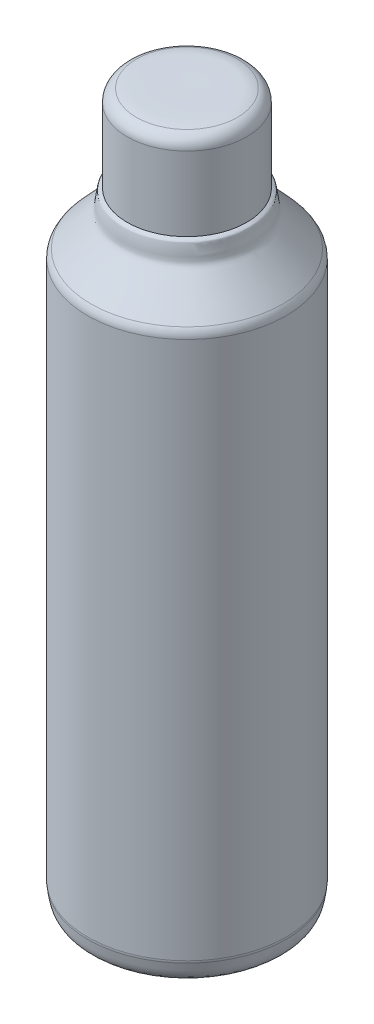
ISO-10303-21;
HEADER;
FILE_DESCRIPTION(('STEP AP214'),'2;1');
FILE_NAME('part.step','',(''),(''),'','','');
FILE_SCHEMA(('AUTOMOTIVE_DESIGN { 1 0 10303 214 1 1 1 1 }'));
ENDSEC;
DATA;
#1=APPLICATION_CONTEXT('core data for automotive mechanical design processes');
#2=APPLICATION_PROTOCOL_DEFINITION('international standard','automotive_design',2000,#1);
#3=PRODUCT_CONTEXT('',#1,'mechanical');
#4=PRODUCT('Part','Part','',(#3));
#5=PRODUCT_RELATED_PRODUCT_CATEGORY('part','',(#4));
#6=PRODUCT_DEFINITION_FORMATION('','',#4);
#7=PRODUCT_DEFINITION_CONTEXT('part definition',#1,'design');
#8=PRODUCT_DEFINITION('design','',#6,#7);
#9=PRODUCT_DEFINITION_SHAPE('','',#8);
#10=(LENGTH_UNIT() NAMED_UNIT(*) SI_UNIT(.MILLI.,.METRE.));
#11=(NAMED_UNIT(*) PLANE_ANGLE_UNIT() SI_UNIT($,.RADIAN.));
#12=(NAMED_UNIT(*) SI_UNIT($,.STERADIAN.) SOLID_ANGLE_UNIT());
#13=UNCERTAINTY_MEASURE_WITH_UNIT(LENGTH_MEASURE(1.E-05),#10,'distance_accuracy_value','');
#14=(GEOMETRIC_REPRESENTATION_CONTEXT(3) GLOBAL_UNCERTAINTY_ASSIGNED_CONTEXT((#13)) GLOBAL_UNIT_ASSIGNED_CONTEXT((#10,
#11,#12)) REPRESENTATION_CONTEXT('',''));
#15=CARTESIAN_POINT('',(0.,0.,0.));
#16=DIRECTION('',(0.,0.,1.));
#17=DIRECTION('',(1.,0.,0.));
#18=AXIS2_PLACEMENT_3D('',#15,#16,#17);
#19=CARTESIAN_POINT('',(253.,513.,0.));
#20=CARTESIAN_POINT('',(248.636070131771,510.818035065885,0.));
#21=CARTESIAN_POINT('',(250.831851320473,512.548639495541,0.));
#22=CARTESIAN_POINT('',(249.,504.,0.));
#23=CARTESIAN_POINT('',(248.575161436687,502.017420037871,0.));
#24=CARTESIAN_POINT('',(248.753027096743,499.882567741857,0.));
#25=CARTESIAN_POINT('',(248.,498.,0.));
#26=CARTESIAN_POINT('',(247.38101553941,496.452538848524,0.));
#27=CARTESIAN_POINT('',(246.097507679781,495.254294491178,0.));
#28=CARTESIAN_POINT('',(245.,494.,0.));
#29=CARTESIAN_POINT('',(238.404943019685,486.462792022498,0.));
#30=CARTESIAN_POINT('',(231.364357937615,479.199956821867,0.));
#31=CARTESIAN_POINT('',(224.604387653401,471.772395410952,0.));
#32=B_SPLINE_CURVE_WITH_KNOTS('',3,(#19,#20,#21,#22,#23,#24,#25,#26,#27,#28,#29,#30,#31),
.UNSPECIFIED.,.F.,.F.,(4,3,3,3,4),(1.0735522867203,2.0735522867203,3.0735522867203,
4.0735522867203,5.),.UNSPECIFIED.);
#33=CARTESIAN_POINT('',(299.869822457415,19.9699814524605,0.));
#34=DIRECTION('',(0.,-1.,0.));
#35=AXIS1_PLACEMENT('',#33,#34);
#36=SURFACE_OF_REVOLUTION('',#32,#35);
#37=CARTESIAN_POINT('',(299.869822457415,471.772395410952,0.));
#38=DIRECTION('',(0.,-1.,0.));
#39=DIRECTION('',(1.,0.,0.));
#40=AXIS2_PLACEMENT_3D('',#37,#38,#39);
#41=CIRCLE('',#40,75.2654348040142);
#42=CARTESIAN_POINT('',(375.13525726143,471.772395410952,0.));
#43=VERTEX_POINT('',#42);
#44=EDGE_CURVE('E11',#43,#43,#41,.T.);
#45=ORIENTED_EDGE('',*,*,#44,.F.);
#46=EDGE_LOOP('',(#45));
#47=FACE_BOUND('',#46,.T.);
#48=CARTESIAN_POINT('',(299.869822457415,513.,0.));
#49=DIRECTION('',(0.,-1.,0.));
#50=DIRECTION('',(1.,0.,0.));
#51=AXIS2_PLACEMENT_3D('',#48,#49,#50);
#52=CIRCLE('',#51,46.8698224574154);
#53=CARTESIAN_POINT('',(346.739644914831,513.,0.));
#54=VERTEX_POINT('',#53);
#55=EDGE_CURVE('E95',#54,#54,#52,.T.);
#56=ORIENTED_EDGE('',*,*,#55,.T.);
#57=EDGE_LOOP('',(#56));
#58=FACE_BOUND('',#57,.T.);
#59=ADVANCED_FACE('F39',(#47,#58),#36,.T.);
#60=CARTESIAN_POINT('',(299.869822457415,465.04150260098,0.));
#61=DIRECTION('',(0.,-1.,0.));
#62=DIRECTION('',(1.,0.,0.));
#63=AXIS2_PLACEMENT_3D('',#60,#61,#62);
#64=TOROIDAL_SURFACE('',#63,67.8698224574485,10.);
#65=CARTESIAN_POINT('',(299.869822457415,465.04150260098,0.));
#66=DIRECTION('',(0.,-1.,0.));
#67=DIRECTION('',(1.,0.,0.));
#68=AXIS2_PLACEMENT_3D('',#65,#66,#67);
#69=CIRCLE('',#68,77.8698224574485);
#70=CARTESIAN_POINT('',(377.739644914864,465.04150260098,0.));
#71=VERTEX_POINT('',#70);
#72=EDGE_CURVE('E48',#71,#71,#69,.T.);
#73=ORIENTED_EDGE('',*,*,#72,.F.);
#74=EDGE_LOOP('',(#73));
#75=FACE_BOUND('',#74,.T.);
#76=ORIENTED_EDGE('',*,*,#44,.T.);
#77=EDGE_LOOP('',(#76));
#78=FACE_BOUND('',#77,.T.);
#79=ADVANCED_FACE('F86',(#75,#78),#64,.T.);
#80=CARTESIAN_POINT('',(299.869822457415,19.9699814524605,0.));
#81=DIRECTION('',(0.,-1.,0.));
#82=DIRECTION('',(1.,0.,0.));
#83=AXIS2_PLACEMENT_3D('',#80,#81,#82);
#84=CYLINDRICAL_SURFACE('',#83,77.8698224574485);
#85=CARTESIAN_POINT('',(299.869822457415,42.9190411149607,0.));
#86=DIRECTION('',(0.,-1.,0.));
#87=DIRECTION('',(1.,0.,0.));
#88=AXIS2_PLACEMENT_3D('',#85,#86,#87);
#89=CIRCLE('',#88,77.8698224574486);
#90=CARTESIAN_POINT('',(377.739644914864,42.9190411149607,0.));
#91=VERTEX_POINT('',#90);
#92=EDGE_CURVE('E71',#91,#91,#89,.T.);
#93=ORIENTED_EDGE('',*,*,#92,.F.);
#94=EDGE_LOOP('',(#93));
#95=FACE_BOUND('',#94,.T.);
#96=ORIENTED_EDGE('',*,*,#72,.T.);
#97=EDGE_LOOP('',(#96));
#98=FACE_BOUND('',#97,.T.);
#99=ADVANCED_FACE('F84',(#95,#98),#84,.T.);
#100=CARTESIAN_POINT('',(299.869822457415,42.9190411149607,0.));
#101=DIRECTION('',(0.,-1.,0.));
#102=DIRECTION('',(1.,0.,0.));
#103=AXIS2_PLACEMENT_3D('',#100,#101,#102);
#104=TOROIDAL_SURFACE('',#103,67.8698224574486,10.);
#105=CARTESIAN_POINT('',(299.869822457415,41.2064059244615,0.));
#106=DIRECTION('',(0.,-1.,0.));
#107=DIRECTION('',(1.,0.,0.));
#108=AXIS2_PLACEMENT_3D('',#105,#106,#107);
#109=CIRCLE('',#108,77.7220750275091);
#110=CARTESIAN_POINT('',(377.591897484925,41.2064059244615,0.));
#111=VERTEX_POINT('',#110);
#112=EDGE_CURVE('E65',#111,#111,#109,.T.);
#113=ORIENTED_EDGE('',*,*,#112,.F.);
#114=EDGE_LOOP('',(#113));
#115=FACE_BOUND('',#114,.T.);
#116=ORIENTED_EDGE('',*,*,#92,.T.);
#117=EDGE_LOOP('',(#116));
#118=FACE_BOUND('',#117,.T.);
#119=ADVANCED_FACE('F122',(#115,#118),#104,.T.);
#120=CARTESIAN_POINT('',(222.147747429906,41.2064059244615,0.));
#121=CARTESIAN_POINT('',(223.012565993216,36.2313762390569,0.));
#122=CARTESIAN_POINT('',(223.00148251259,30.4171982708159,0.));
#123=CARTESIAN_POINT('',(227.708226392647,27.1926687301409,0.));
#124=B_SPLINE_CURVE_WITH_KNOTS('',3,(#120,#121,#122,#123),.UNSPECIFIED.,.F.,.F.,(4,4),
(8.01885503297851,8.95000324390909),.UNSPECIFIED.);
#125=CARTESIAN_POINT('',(299.869822457415,19.9699814524605,0.));
#126=DIRECTION('',(0.,-1.,0.));
#127=AXIS1_PLACEMENT('',#125,#126);
#128=SURFACE_OF_REVOLUTION('',#124,#127);
#129=CARTESIAN_POINT('',(299.869822457415,27.1926687301409,0.));
#130=DIRECTION('',(0.,-1.,0.));
#131=DIRECTION('',(1.,0.,0.));
#132=AXIS2_PLACEMENT_3D('',#129,#130,#131);
#133=CIRCLE('',#132,72.1615960647687);
#134=CARTESIAN_POINT('',(372.031418522184,27.1926687301409,0.));
#135=VERTEX_POINT('',#134);
#136=EDGE_CURVE('E62',#135,#135,#133,.T.);
#137=ORIENTED_EDGE('',*,*,#136,.F.);
#138=EDGE_LOOP('',(#137));
#139=FACE_BOUND('',#138,.T.);
#140=ORIENTED_EDGE('',*,*,#112,.T.);
#141=EDGE_LOOP('',(#140));
#142=FACE_BOUND('',#141,.T.);
#143=ADVANCED_FACE('F58',(#139,#142),#128,.T.);
#144=CARTESIAN_POINT('',(227.708226392647,27.1926687301409,0.));
#145=CARTESIAN_POINT('',(245.269197516341,19.9063838928205,0.));
#146=CARTESIAN_POINT('',(299.869822457415,19.9699814524605,0.));
#147=B_SPLINE_CURVE_WITH_KNOTS('',2,(#144,#145,#146),.UNSPECIFIED.,.F.,.F.,(3,3),(0.,
0.455690213600449),.UNSPECIFIED.);
#148=CARTESIAN_POINT('',(299.869822457415,19.9699814524605,0.));
#149=DIRECTION('',(0.,-1.,0.));
#150=AXIS1_PLACEMENT('',#148,#149);
#151=SURFACE_OF_REVOLUTION('',#147,#150);
#152=CARTESIAN_POINT('',(299.869822457415,19.9699814524605,0.));
#153=VERTEX_POINT('',#152);
#154=VERTEX_LOOP('',#153);
#155=FACE_BOUND('',#154,.T.);
#156=ORIENTED_EDGE('',*,*,#136,.T.);
#157=EDGE_LOOP('',(#156));
#158=FACE_BOUND('',#157,.T.);
#159=ADVANCED_FACE('F54',(#155,#158),#151,.T.);
#160=CARTESIAN_POINT('',(299.869822457415,581.930630500446,0.));
#161=CARTESIAN_POINT('',(289.579854883486,582.08445333379,0.));
#162=CARTESIAN_POINT('',(279.289376504927,582.136133423188,0.));
#163=CARTESIAN_POINT('',(269.,582.009104083621,0.));
#164=CARTESIAN_POINT('',(266.059385675291,581.972800203069,0.));
#165=CARTESIAN_POINT('',(263.082956960989,581.563236015625,0.));
#166=CARTESIAN_POINT('',(260.243694035787,580.749112079508,0.));
#167=B_SPLINE_CURVE_WITH_KNOTS('',3,(#160,#161,#162,#163,#164,#165,#166),.UNSPECIFIED.,.F.,.F.,
(4,3,4),(1.21089024740118,1.65185213673306,2.44096188933189),.UNSPECIFIED.);
#168=CARTESIAN_POINT('',(299.869822457415,19.9699814524605,0.));
#169=DIRECTION('',(0.,-1.,0.));
#170=AXIS1_PLACEMENT('',#168,#169);
#171=SURFACE_OF_REVOLUTION('',#167,#170);
#172=CARTESIAN_POINT('',(299.869822457415,580.749112079507,0.));
#173=DIRECTION('',(0.,-1.,0.));
#174=DIRECTION('',(1.,0.,0.));
#175=AXIS2_PLACEMENT_3D('',#172,#173,#174);
#176=CIRCLE('',#175,39.6261284216331);
#177=CARTESIAN_POINT('',(339.495950879049,580.749112079507,0.));
#178=VERTEX_POINT('',#177);
#179=EDGE_CURVE('E66',#178,#178,#176,.T.);
#180=ORIENTED_EDGE('',*,*,#179,.F.);
#181=EDGE_LOOP('',(#180));
#182=FACE_BOUND('',#181,.T.);
#183=CARTESIAN_POINT('',(299.869822457415,581.930630500446,0.));
#184=VERTEX_POINT('',#183);
#185=VERTEX_LOOP('',#184);
#186=FACE_BOUND('',#185,.T.);
#187=ADVANCED_FACE('F57',(#182,#186),#171,.T.);
#188=CARTESIAN_POINT('',(299.869822457415,571.136475738127,0.));
#189=DIRECTION('',(0.,-1.,0.));
#190=DIRECTION('',(1.,0.,0.));
#191=AXIS2_PLACEMENT_3D('',#188,#189,#190);
#192=TOROIDAL_SURFACE('',#191,36.8698224574154,10.);
#193=CARTESIAN_POINT('',(299.869822457415,571.136475738127,0.));
#194=DIRECTION('',(0.,-1.,0.));
#195=DIRECTION('',(1.,0.,0.));
#196=AXIS2_PLACEMENT_3D('',#193,#194,#195);
#197=CIRCLE('',#196,46.8698224574156);
#198=CARTESIAN_POINT('',(346.739644914831,571.136475738127,0.));
#199=VERTEX_POINT('',#198);
#200=EDGE_CURVE('E74',#199,#199,#197,.T.);
#201=ORIENTED_EDGE('',*,*,#200,.F.);
#202=EDGE_LOOP('',(#201));
#203=FACE_BOUND('',#202,.T.);
#204=ORIENTED_EDGE('',*,*,#179,.T.);
#205=EDGE_LOOP('',(#204));
#206=FACE_BOUND('',#205,.T.);
#207=ADVANCED_FACE('F116',(#203,#206),#192,.T.);
#208=CARTESIAN_POINT('',(299.869822457415,19.9699814524605,0.));
#209=DIRECTION('',(0.,-1.,0.));
#210=DIRECTION('',(1.,0.,0.));
#211=AXIS2_PLACEMENT_3D('',#208,#209,#210);
#212=CYLINDRICAL_SURFACE('',#211,46.8698224574155);
#213=ORIENTED_EDGE('',*,*,#55,.F.);
#214=EDGE_LOOP('',(#213));
#215=FACE_BOUND('',#214,.T.);
#216=ORIENTED_EDGE('',*,*,#200,.T.);
#217=EDGE_LOOP('',(#216));
#218=FACE_BOUND('',#217,.T.);
#219=ADVANCED_FACE('F168',(#215,#218),#212,.T.);
#220=CLOSED_SHELL('',(#59,#79,#99,#119,#143,#159,#187,#207,#219));
#221=MANIFOLD_SOLID_BREP('B2',#220);
#222=ADVANCED_BREP_SHAPE_REPRESENTATION('',(#18,#221),#14);
#223=SHAPE_DEFINITION_REPRESENTATION(#9,#222);
ENDSEC;
END-ISO-10303-21;
